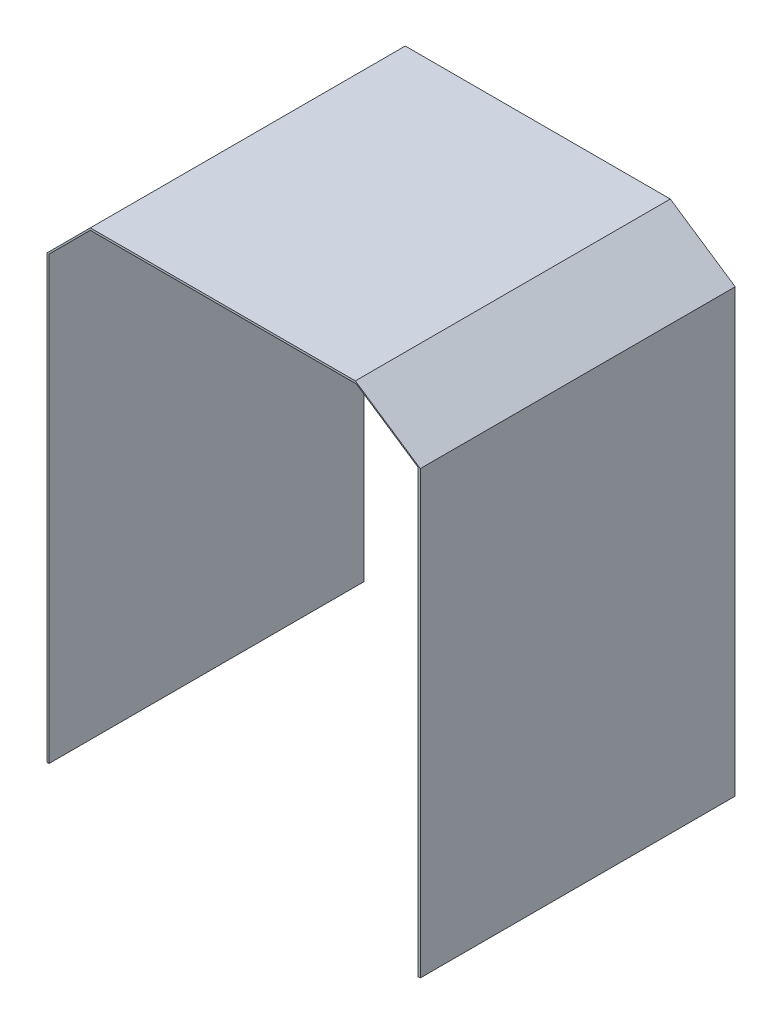
ISO-10303-21;
HEADER;
FILE_DESCRIPTION(('STEP AP214'),'2;1');
FILE_NAME('part.step','',(''),(''),'','','');
FILE_SCHEMA(('AUTOMOTIVE_DESIGN { 1 0 10303 214 1 1 1 1 }'));
ENDSEC;
DATA;
#1=APPLICATION_CONTEXT('core data for automotive mechanical design processes');
#2=APPLICATION_PROTOCOL_DEFINITION('international standard','automotive_design',2000,#1);
#3=PRODUCT_CONTEXT('',#1,'mechanical');
#4=PRODUCT('Part','Part','',(#3));
#5=PRODUCT_RELATED_PRODUCT_CATEGORY('part','',(#4));
#6=PRODUCT_DEFINITION_FORMATION('','',#4);
#7=PRODUCT_DEFINITION_CONTEXT('part definition',#1,'design');
#8=PRODUCT_DEFINITION('design','',#6,#7);
#9=PRODUCT_DEFINITION_SHAPE('','',#8);
#10=(LENGTH_UNIT() NAMED_UNIT(*) SI_UNIT(.MILLI.,.METRE.));
#11=(NAMED_UNIT(*) PLANE_ANGLE_UNIT() SI_UNIT($,.RADIAN.));
#12=(NAMED_UNIT(*) SI_UNIT($,.STERADIAN.) SOLID_ANGLE_UNIT());
#13=UNCERTAINTY_MEASURE_WITH_UNIT(LENGTH_MEASURE(1.E-05),#10,'distance_accuracy_value','');
#14=(GEOMETRIC_REPRESENTATION_CONTEXT(3) GLOBAL_UNCERTAINTY_ASSIGNED_CONTEXT((#13)) GLOBAL_UNIT_ASSIGNED_CONTEXT((#10,
#11,#12)) REPRESENTATION_CONTEXT('',''));
#15=CARTESIAN_POINT('',(0.,0.,0.));
#16=DIRECTION('',(0.,0.,1.));
#17=DIRECTION('',(1.,0.,0.));
#18=AXIS2_PLACEMENT_3D('',#15,#16,#17);
#19=CARTESIAN_POINT('',(0.,0.,32.2));
#20=DIRECTION('',(0.,1.,0.));
#21=DIRECTION('',(0.,0.,1.));
#22=AXIS2_PLACEMENT_3D('',#19,#20,#21);
#23=PLANE('',#22);
#24=DIRECTION('',(1.,0.,0.));
#25=VECTOR('',#24,1.);
#26=CARTESIAN_POINT('',(0.,0.,0.));
#27=LINE('',#26,#25);
#28=CARTESIAN_POINT('',(0.,0.,0.));
#29=VERTEX_POINT('',#28);
#30=CARTESIAN_POINT('',(0.22,0.,0.));
#31=VERTEX_POINT('',#30);
#32=EDGE_CURVE('E159',#29,#31,#27,.T.);
#33=ORIENTED_EDGE('',*,*,#32,.T.);
#34=DIRECTION('',(0.,0.,-1.));
#35=VECTOR('',#34,1.);
#36=CARTESIAN_POINT('',(0.22,0.,32.2));
#37=LINE('',#36,#35);
#38=CARTESIAN_POINT('',(0.22,0.,32.2));
#39=VERTEX_POINT('',#38);
#40=EDGE_CURVE('E11',#39,#31,#37,.T.);
#41=ORIENTED_EDGE('',*,*,#40,.F.);
#42=DIRECTION('',(1.,0.,0.));
#43=VECTOR('',#42,1.);
#44=CARTESIAN_POINT('',(0.,0.,32.2));
#45=LINE('',#44,#43);
#46=CARTESIAN_POINT('',(0.,0.,32.2));
#47=VERTEX_POINT('',#46);
#48=EDGE_CURVE('E181',#47,#39,#45,.T.);
#49=ORIENTED_EDGE('',*,*,#48,.F.);
#50=DIRECTION('',(0.,0.,-1.));
#51=VECTOR('',#50,1.);
#52=CARTESIAN_POINT('',(0.,0.,32.2));
#53=LINE('',#52,#51);
#54=EDGE_CURVE('E155',#47,#29,#53,.T.);
#55=ORIENTED_EDGE('',*,*,#54,.T.);
#56=EDGE_LOOP('',(#33,#41,#49,#55));
#57=FACE_BOUND('',#56,.T.);
#58=ADVANCED_FACE('F39',(#57),#23,.F.);
#59=CARTESIAN_POINT('',(0.22,0.,32.2));
#60=DIRECTION('',(-1.,0.,0.));
#61=DIRECTION('',(0.,0.,1.));
#62=AXIS2_PLACEMENT_3D('',#59,#60,#61);
#63=PLANE('',#62);
#64=DIRECTION('',(0.,1.,0.));
#65=VECTOR('',#64,1.);
#66=CARTESIAN_POINT('',(0.22,0.,0.));
#67=LINE('',#66,#65);
#68=CARTESIAN_POINT('',(0.22,45.1,0.));
#69=VERTEX_POINT('',#68);
#70=EDGE_CURVE('E162',#31,#69,#67,.T.);
#71=ORIENTED_EDGE('',*,*,#70,.T.);
#72=DIRECTION('',(0.,0.,-1.));
#73=VECTOR('',#72,1.);
#74=CARTESIAN_POINT('',(0.22,45.1,32.2));
#75=LINE('',#74,#73);
#76=CARTESIAN_POINT('',(0.22,45.1,32.2));
#77=VERTEX_POINT('',#76);
#78=EDGE_CURVE('E47',#77,#69,#75,.T.);
#79=ORIENTED_EDGE('',*,*,#78,.F.);
#80=DIRECTION('',(0.,1.,0.));
#81=VECTOR('',#80,1.);
#82=CARTESIAN_POINT('',(0.22,0.,32.2));
#83=LINE('',#82,#81);
#84=EDGE_CURVE('E110',#39,#77,#83,.T.);
#85=ORIENTED_EDGE('',*,*,#84,.F.);
#86=ORIENTED_EDGE('',*,*,#40,.T.);
#87=EDGE_LOOP('',(#71,#79,#85,#86));
#88=FACE_BOUND('',#87,.T.);
#89=ADVANCED_FACE('F259',(#88),#63,.F.);
#90=CARTESIAN_POINT('',(0.22,45.1,32.2));
#91=DIRECTION('',(-0.707106781186548,0.707106781186547,0.));
#92=DIRECTION('',(-0.707106781186547,-0.707106781186548,0.));
#93=AXIS2_PLACEMENT_3D('',#90,#91,#92);
#94=PLANE('',#93);
#95=DIRECTION('',(0.707106781186547,0.707106781186548,0.));
#96=VECTOR('',#95,1.);
#97=CARTESIAN_POINT('',(0.22,45.1,0.));
#98=LINE('',#97,#96);
#99=CARTESIAN_POINT('',(4.45060286870172,49.3306028687017,0.));
#100=VERTEX_POINT('',#99);
#101=EDGE_CURVE('E164',#69,#100,#98,.T.);
#102=ORIENTED_EDGE('',*,*,#101,.T.);
#103=DIRECTION('',(0.,0.,-1.));
#104=VECTOR('',#103,1.);
#105=CARTESIAN_POINT('',(4.45060286870172,49.3306028687017,32.2));
#106=LINE('',#105,#104);
#107=CARTESIAN_POINT('',(4.45060286870172,49.3306028687017,32.2));
#108=VERTEX_POINT('',#107);
#109=EDGE_CURVE('E200',#108,#100,#106,.T.);
#110=ORIENTED_EDGE('',*,*,#109,.F.);
#111=DIRECTION('',(0.707106781186547,0.707106781186548,0.));
#112=VECTOR('',#111,1.);
#113=CARTESIAN_POINT('',(0.22,45.1,32.2));
#114=LINE('',#113,#112);
#115=EDGE_CURVE('E208',#77,#108,#114,.T.);
#116=ORIENTED_EDGE('',*,*,#115,.F.);
#117=ORIENTED_EDGE('',*,*,#78,.T.);
#118=EDGE_LOOP('',(#102,#110,#116,#117));
#119=FACE_BOUND('',#118,.T.);
#120=ADVANCED_FACE('F206',(#119),#94,.F.);
#121=CARTESIAN_POINT('',(4.45060286870172,49.3306028687017,32.2));
#122=DIRECTION('',(0.,1.,0.));
#123=DIRECTION('',(0.,0.,1.));
#124=AXIS2_PLACEMENT_3D('',#121,#122,#123);
#125=PLANE('',#124);
#126=DIRECTION('',(1.,0.,0.));
#127=VECTOR('',#126,1.);
#128=CARTESIAN_POINT('',(4.45060286870172,49.3306028687017,0.));
#129=LINE('',#128,#127);
#130=CARTESIAN_POINT('',(31.6554133581781,49.3306028687017,0.));
#131=VERTEX_POINT('',#130);
#132=EDGE_CURVE('E166',#100,#131,#129,.T.);
#133=ORIENTED_EDGE('',*,*,#132,.T.);
#134=DIRECTION('',(0.,0.,-1.));
#135=VECTOR('',#134,1.);
#136=CARTESIAN_POINT('',(31.6554133581781,49.3306028687017,32.2));
#137=LINE('',#136,#135);
#138=CARTESIAN_POINT('',(31.6554133581781,49.3306028687017,32.2));
#139=VERTEX_POINT('',#138);
#140=EDGE_CURVE('E197',#139,#131,#137,.T.);
#141=ORIENTED_EDGE('',*,*,#140,.F.);
#142=DIRECTION('',(1.,0.,0.));
#143=VECTOR('',#142,1.);
#144=CARTESIAN_POINT('',(4.45060286870172,49.3306028687017,32.2));
#145=LINE('',#144,#143);
#146=EDGE_CURVE('E226',#108,#139,#145,.T.);
#147=ORIENTED_EDGE('',*,*,#146,.F.);
#148=ORIENTED_EDGE('',*,*,#109,.T.);
#149=EDGE_LOOP('',(#133,#141,#147,#148));
#150=FACE_BOUND('',#149,.T.);
#151=ADVANCED_FACE('F217',(#150),#125,.F.);
#152=CARTESIAN_POINT('',(31.6554133581781,49.3306028687017,32.2));
#153=DIRECTION('',(0.556989160868501,0.830519761760672,0.));
#154=DIRECTION('',(-0.830519761760672,0.556989160868501,0.));
#155=AXIS2_PLACEMENT_3D('',#152,#153,#154);
#156=PLANE('',#155);
#157=DIRECTION('',(0.830519761760672,-0.556989160868501,0.));
#158=VECTOR('',#157,1.);
#159=CARTESIAN_POINT('',(31.6554133581781,49.3306028687017,0.));
#160=LINE('',#159,#158);
#161=CARTESIAN_POINT('',(37.9636138286137,45.1,0.));
#162=VERTEX_POINT('',#161);
#163=EDGE_CURVE('E168',#131,#162,#160,.T.);
#164=ORIENTED_EDGE('',*,*,#163,.T.);
#165=DIRECTION('',(0.,0.,-1.));
#166=VECTOR('',#165,1.);
#167=CARTESIAN_POINT('',(37.9636138286137,45.1,32.2));
#168=LINE('',#167,#166);
#169=CARTESIAN_POINT('',(37.9636138286137,45.1,32.2));
#170=VERTEX_POINT('',#169);
#171=EDGE_CURVE('E194',#170,#162,#168,.T.);
#172=ORIENTED_EDGE('',*,*,#171,.F.);
#173=DIRECTION('',(0.830519761760672,-0.556989160868501,0.));
#174=VECTOR('',#173,1.);
#175=CARTESIAN_POINT('',(31.6554133581781,49.3306028687017,32.2));
#176=LINE('',#175,#174);
#177=EDGE_CURVE('E223',#139,#170,#176,.T.);
#178=ORIENTED_EDGE('',*,*,#177,.F.);
#179=ORIENTED_EDGE('',*,*,#140,.T.);
#180=EDGE_LOOP('',(#164,#172,#178,#179));
#181=FACE_BOUND('',#180,.T.);
#182=ADVANCED_FACE('F221',(#181),#156,.F.);
#183=CARTESIAN_POINT('',(37.9636138286137,45.1,32.2));
#184=DIRECTION('',(1.,0.,0.));
#185=DIRECTION('',(0.,0.,-1.));
#186=AXIS2_PLACEMENT_3D('',#183,#184,#185);
#187=PLANE('',#186);
#188=DIRECTION('',(0.,-1.,0.));
#189=VECTOR('',#188,1.);
#190=CARTESIAN_POINT('',(37.9636138286137,45.1,0.));
#191=LINE('',#190,#189);
#192=CARTESIAN_POINT('',(37.9636138286137,0.,0.));
#193=VERTEX_POINT('',#192);
#194=EDGE_CURVE('E170',#162,#193,#191,.T.);
#195=ORIENTED_EDGE('',*,*,#194,.T.);
#196=DIRECTION('',(0.,0.,-1.));
#197=VECTOR('',#196,1.);
#198=CARTESIAN_POINT('',(37.9636138286137,0.,32.2));
#199=LINE('',#198,#197);
#200=CARTESIAN_POINT('',(37.9636138286137,0.,32.2));
#201=VERTEX_POINT('',#200);
#202=EDGE_CURVE('E191',#201,#193,#199,.T.);
#203=ORIENTED_EDGE('',*,*,#202,.F.);
#204=DIRECTION('',(0.,-1.,0.));
#205=VECTOR('',#204,1.);
#206=CARTESIAN_POINT('',(37.9636138286137,45.1,32.2));
#207=LINE('',#206,#205);
#208=EDGE_CURVE('E225',#170,#201,#207,.T.);
#209=ORIENTED_EDGE('',*,*,#208,.F.);
#210=ORIENTED_EDGE('',*,*,#171,.T.);
#211=EDGE_LOOP('',(#195,#203,#209,#210));
#212=FACE_BOUND('',#211,.T.);
#213=ADVANCED_FACE('F272',(#212),#187,.F.);
#214=CARTESIAN_POINT('',(37.9636138286137,0.,32.2));
#215=DIRECTION('',(0.,1.,0.));
#216=DIRECTION('',(-1.,0.,0.));
#217=AXIS2_PLACEMENT_3D('',#214,#215,#216);
#218=PLANE('',#217);
#219=DIRECTION('',(1.,0.,0.));
#220=VECTOR('',#219,1.);
#221=CARTESIAN_POINT('',(37.9636138286137,0.,0.));
#222=LINE('',#221,#220);
#223=CARTESIAN_POINT('',(38.1836138286137,0.,0.));
#224=VERTEX_POINT('',#223);
#225=EDGE_CURVE('E172',#193,#224,#222,.T.);
#226=ORIENTED_EDGE('',*,*,#225,.T.);
#227=DIRECTION('',(0.,0.,-1.));
#228=VECTOR('',#227,1.);
#229=CARTESIAN_POINT('',(38.1836138286137,0.,32.2));
#230=LINE('',#229,#228);
#231=CARTESIAN_POINT('',(38.1836138286137,0.,32.2));
#232=VERTEX_POINT('',#231);
#233=EDGE_CURVE('E188',#232,#224,#230,.T.);
#234=ORIENTED_EDGE('',*,*,#233,.F.);
#235=DIRECTION('',(1.,0.,0.));
#236=VECTOR('',#235,1.);
#237=CARTESIAN_POINT('',(37.9636138286137,0.,32.2));
#238=LINE('',#237,#236);
#239=EDGE_CURVE('E228',#201,#232,#238,.T.);
#240=ORIENTED_EDGE('',*,*,#239,.F.);
#241=ORIENTED_EDGE('',*,*,#202,.T.);
#242=EDGE_LOOP('',(#226,#234,#240,#241));
#243=FACE_BOUND('',#242,.T.);
#244=ADVANCED_FACE('F275',(#243),#218,.F.);
#245=CARTESIAN_POINT('',(38.1836138286137,0.,32.2));
#246=DIRECTION('',(-1.,0.,0.));
#247=DIRECTION('',(0.,0.,1.));
#248=AXIS2_PLACEMENT_3D('',#245,#246,#247);
#249=PLANE('',#248);
#250=DIRECTION('',(0.,1.,0.));
#251=VECTOR('',#250,1.);
#252=CARTESIAN_POINT('',(38.1836138286137,0.,0.));
#253=LINE('',#252,#251);
#254=CARTESIAN_POINT('',(38.1836138286137,45.1,0.));
#255=VERTEX_POINT('',#254);
#256=EDGE_CURVE('E174',#224,#255,#253,.T.);
#257=ORIENTED_EDGE('',*,*,#256,.T.);
#258=DIRECTION('',(0.,0.,-1.));
#259=VECTOR('',#258,1.);
#260=CARTESIAN_POINT('',(38.1836138286137,45.1,32.2));
#261=LINE('',#260,#259);
#262=CARTESIAN_POINT('',(38.1836138286137,45.1,32.2));
#263=VERTEX_POINT('',#262);
#264=EDGE_CURVE('E185',#263,#255,#261,.T.);
#265=ORIENTED_EDGE('',*,*,#264,.F.);
#266=DIRECTION('',(0.,1.,0.));
#267=VECTOR('',#266,1.);
#268=CARTESIAN_POINT('',(38.1836138286137,0.,32.2));
#269=LINE('',#268,#267);
#270=EDGE_CURVE('E234',#232,#263,#269,.T.);
#271=ORIENTED_EDGE('',*,*,#270,.F.);
#272=ORIENTED_EDGE('',*,*,#233,.T.);
#273=EDGE_LOOP('',(#257,#265,#271,#272));
#274=FACE_BOUND('',#273,.T.);
#275=ADVANCED_FACE('F240',(#274),#249,.F.);
#276=CARTESIAN_POINT('',(38.1836138286137,45.1,32.2));
#277=DIRECTION('',(-0.556989160868502,-0.830519761760671,0.));
#278=DIRECTION('',(0.830519761760671,-0.556989160868502,0.));
#279=AXIS2_PLACEMENT_3D('',#276,#277,#278);
#280=PLANE('',#279);
#281=DIRECTION('',(-0.830519761760671,0.556989160868502,0.));
#282=VECTOR('',#281,1.);
#283=CARTESIAN_POINT('',(38.1836138286137,45.1,0.));
#284=LINE('',#283,#282);
#285=CARTESIAN_POINT('',(31.5473740345719,49.5506028687017,0.));
#286=VERTEX_POINT('',#285);
#287=EDGE_CURVE('E176',#255,#286,#284,.T.);
#288=ORIENTED_EDGE('',*,*,#287,.T.);
#289=DIRECTION('',(0.,0.,-1.));
#290=VECTOR('',#289,1.);
#291=CARTESIAN_POINT('',(31.5473740345719,49.5506028687017,32.2));
#292=LINE('',#291,#290);
#293=CARTESIAN_POINT('',(31.5473740345719,49.5506028687017,32.2));
#294=VERTEX_POINT('',#293);
#295=EDGE_CURVE('E150',#294,#286,#292,.T.);
#296=ORIENTED_EDGE('',*,*,#295,.F.);
#297=DIRECTION('',(-0.830519761760671,0.556989160868502,0.));
#298=VECTOR('',#297,1.);
#299=CARTESIAN_POINT('',(38.1836138286137,45.1,32.2));
#300=LINE('',#299,#298);
#301=EDGE_CURVE('E141',#263,#294,#300,.T.);
#302=ORIENTED_EDGE('',*,*,#301,.F.);
#303=ORIENTED_EDGE('',*,*,#264,.T.);
#304=EDGE_LOOP('',(#288,#296,#302,#303));
#305=FACE_BOUND('',#304,.T.);
#306=ADVANCED_FACE('F244',(#305),#280,.F.);
#307=CARTESIAN_POINT('',(31.5473740345719,49.5506028687017,32.2));
#308=DIRECTION('',(0.,-1.,0.));
#309=DIRECTION('',(0.,0.,-1.));
#310=AXIS2_PLACEMENT_3D('',#307,#308,#309);
#311=PLANE('',#310);
#312=DIRECTION('',(-1.,0.,0.));
#313=VECTOR('',#312,1.);
#314=CARTESIAN_POINT('',(31.5473740345719,49.5506028687017,0.));
#315=LINE('',#314,#313);
#316=CARTESIAN_POINT('',(4.45060286870172,49.5506028687017,0.));
#317=VERTEX_POINT('',#316);
#318=EDGE_CURVE('E149',#286,#317,#315,.T.);
#319=ORIENTED_EDGE('',*,*,#318,.T.);
#320=DIRECTION('',(0.,0.,-1.));
#321=VECTOR('',#320,1.);
#322=CARTESIAN_POINT('',(4.45060286870172,49.5506028687017,32.2));
#323=LINE('',#322,#321);
#324=CARTESIAN_POINT('',(4.45060286870172,49.5506028687017,32.2));
#325=VERTEX_POINT('',#324);
#326=EDGE_CURVE('E146',#325,#317,#323,.T.);
#327=ORIENTED_EDGE('',*,*,#326,.F.);
#328=DIRECTION('',(-1.,0.,0.));
#329=VECTOR('',#328,1.);
#330=CARTESIAN_POINT('',(31.5473740345719,49.5506028687017,32.2));
#331=LINE('',#330,#329);
#332=EDGE_CURVE('E135',#294,#325,#331,.T.);
#333=ORIENTED_EDGE('',*,*,#332,.F.);
#334=ORIENTED_EDGE('',*,*,#295,.T.);
#335=EDGE_LOOP('',(#319,#327,#333,#334));
#336=FACE_BOUND('',#335,.T.);
#337=ADVANCED_FACE('F147',(#336),#311,.F.);
#338=CARTESIAN_POINT('',(4.45060286870172,49.5506028687017,32.2));
#339=DIRECTION('',(0.707106781186548,-0.707106781186547,0.));
#340=DIRECTION('',(0.707106781186547,0.707106781186548,0.));
#341=AXIS2_PLACEMENT_3D('',#338,#339,#340);
#342=PLANE('',#341);
#343=DIRECTION('',(-0.707106781186547,-0.707106781186548,0.));
#344=VECTOR('',#343,1.);
#345=CARTESIAN_POINT('',(4.45060286870172,49.5506028687017,0.));
#346=LINE('',#345,#344);
#347=CARTESIAN_POINT('',(0.,45.1,0.));
#348=VERTEX_POINT('',#347);
#349=EDGE_CURVE('E96',#317,#348,#346,.T.);
#350=ORIENTED_EDGE('',*,*,#349,.T.);
#351=DIRECTION('',(0.,0.,-1.));
#352=VECTOR('',#351,1.);
#353=CARTESIAN_POINT('',(0.,45.1,32.2));
#354=LINE('',#353,#352);
#355=CARTESIAN_POINT('',(0.,45.1,32.2));
#356=VERTEX_POINT('',#355);
#357=EDGE_CURVE('E151',#356,#348,#354,.T.);
#358=ORIENTED_EDGE('',*,*,#357,.F.);
#359=DIRECTION('',(-0.707106781186547,-0.707106781186548,0.));
#360=VECTOR('',#359,1.);
#361=CARTESIAN_POINT('',(4.45060286870172,49.5506028687017,32.2));
#362=LINE('',#361,#360);
#363=EDGE_CURVE('E139',#325,#356,#362,.T.);
#364=ORIENTED_EDGE('',*,*,#363,.F.);
#365=ORIENTED_EDGE('',*,*,#326,.T.);
#366=EDGE_LOOP('',(#350,#358,#364,#365));
#367=FACE_BOUND('',#366,.T.);
#368=ADVANCED_FACE('F153',(#367),#342,.F.);
#369=CARTESIAN_POINT('',(0.,0.,32.2));
#370=DIRECTION('',(1.,0.,0.));
#371=DIRECTION('',(0.,0.,-1.));
#372=AXIS2_PLACEMENT_3D('',#369,#370,#371);
#373=PLANE('',#372);
#374=DIRECTION('',(0.,-1.,0.));
#375=VECTOR('',#374,1.);
#376=CARTESIAN_POINT('',(0.,0.,0.));
#377=LINE('',#376,#375);
#378=EDGE_CURVE('E102',#348,#29,#377,.T.);
#379=ORIENTED_EDGE('',*,*,#378,.T.);
#380=ORIENTED_EDGE('',*,*,#54,.F.);
#381=DIRECTION('',(0.,-1.,0.));
#382=VECTOR('',#381,1.);
#383=CARTESIAN_POINT('',(0.,0.,32.2));
#384=LINE('',#383,#382);
#385=EDGE_CURVE('E55',#356,#47,#384,.T.);
#386=ORIENTED_EDGE('',*,*,#385,.F.);
#387=ORIENTED_EDGE('',*,*,#357,.T.);
#388=EDGE_LOOP('',(#379,#380,#386,#387));
#389=FACE_BOUND('',#388,.T.);
#390=ADVANCED_FACE('F248',(#389),#373,.F.);
#391=CARTESIAN_POINT('',(0.,0.,32.2));
#392=DIRECTION('',(0.,0.,1.));
#393=DIRECTION('',(1.,0.,0.));
#394=AXIS2_PLACEMENT_3D('',#391,#392,#393);
#395=PLANE('',#394);
#396=ORIENTED_EDGE('',*,*,#48,.T.);
#397=ORIENTED_EDGE('',*,*,#84,.T.);
#398=ORIENTED_EDGE('',*,*,#115,.T.);
#399=ORIENTED_EDGE('',*,*,#146,.T.);
#400=ORIENTED_EDGE('',*,*,#177,.T.);
#401=ORIENTED_EDGE('',*,*,#208,.T.);
#402=ORIENTED_EDGE('',*,*,#239,.T.);
#403=ORIENTED_EDGE('',*,*,#270,.T.);
#404=ORIENTED_EDGE('',*,*,#301,.T.);
#405=ORIENTED_EDGE('',*,*,#332,.T.);
#406=ORIENTED_EDGE('',*,*,#363,.T.);
#407=ORIENTED_EDGE('',*,*,#385,.T.);
#408=EDGE_LOOP('',(#396,#397,#398,#399,#400,#401,#402,#403,#404,#405,#406,#407));
#409=FACE_BOUND('',#408,.T.);
#410=ADVANCED_FACE('F137',(#409),#395,.T.);
#411=CARTESIAN_POINT('',(0.,0.,0.));
#412=DIRECTION('',(0.,0.,1.));
#413=DIRECTION('',(1.,0.,0.));
#414=AXIS2_PLACEMENT_3D('',#411,#412,#413);
#415=PLANE('',#414);
#416=ORIENTED_EDGE('',*,*,#32,.F.);
#417=ORIENTED_EDGE('',*,*,#378,.F.);
#418=ORIENTED_EDGE('',*,*,#349,.F.);
#419=ORIENTED_EDGE('',*,*,#318,.F.);
#420=ORIENTED_EDGE('',*,*,#287,.F.);
#421=ORIENTED_EDGE('',*,*,#256,.F.);
#422=ORIENTED_EDGE('',*,*,#225,.F.);
#423=ORIENTED_EDGE('',*,*,#194,.F.);
#424=ORIENTED_EDGE('',*,*,#163,.F.);
#425=ORIENTED_EDGE('',*,*,#132,.F.);
#426=ORIENTED_EDGE('',*,*,#101,.F.);
#427=ORIENTED_EDGE('',*,*,#70,.F.);
#428=EDGE_LOOP('',(#416,#417,#418,#419,#420,#421,#422,#423,#424,#425,#426,#427));
#429=FACE_BOUND('',#428,.T.);
#430=ADVANCED_FACE('F212',(#429),#415,.F.);
#431=CLOSED_SHELL('',(#58,#89,#120,#151,#182,#213,#244,#275,#306,#337,#368,#390,#410,#430));
#432=MANIFOLD_SOLID_BREP('B2',#431);
#433=ADVANCED_BREP_SHAPE_REPRESENTATION('',(#18,#432),#14);
#434=SHAPE_DEFINITION_REPRESENTATION(#9,#433);
ENDSEC;
END-ISO-10303-21;
